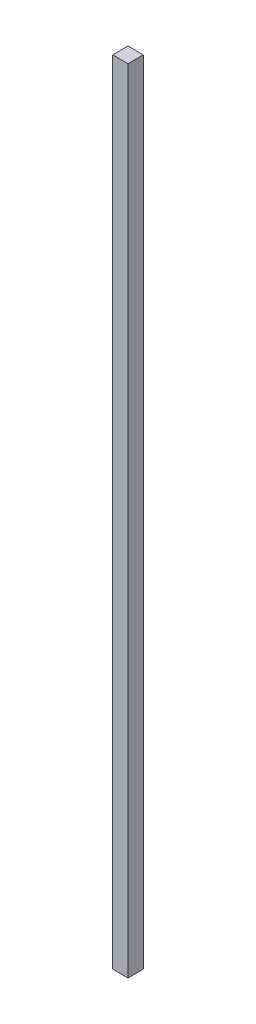
ISO-10303-21;
HEADER;
FILE_DESCRIPTION(('STEP AP214'),'2;1');
FILE_NAME('part.step','',(''),(''),'','','');
FILE_SCHEMA(('AUTOMOTIVE_DESIGN { 1 0 10303 214 1 1 1 1 }'));
ENDSEC;
DATA;
#1=APPLICATION_CONTEXT('core data for automotive mechanical design processes');
#2=APPLICATION_PROTOCOL_DEFINITION('international standard','automotive_design',2000,#1);
#3=PRODUCT_CONTEXT('',#1,'mechanical');
#4=PRODUCT('Part','Part','',(#3));
#5=PRODUCT_RELATED_PRODUCT_CATEGORY('part','',(#4));
#6=PRODUCT_DEFINITION_FORMATION('','',#4);
#7=PRODUCT_DEFINITION_CONTEXT('part definition',#1,'design');
#8=PRODUCT_DEFINITION('design','',#6,#7);
#9=PRODUCT_DEFINITION_SHAPE('','',#8);
#10=(LENGTH_UNIT() NAMED_UNIT(*) SI_UNIT(.MILLI.,.METRE.));
#11=(NAMED_UNIT(*) PLANE_ANGLE_UNIT() SI_UNIT($,.RADIAN.));
#12=(NAMED_UNIT(*) SI_UNIT($,.STERADIAN.) SOLID_ANGLE_UNIT());
#13=UNCERTAINTY_MEASURE_WITH_UNIT(LENGTH_MEASURE(1.E-05),#10,'distance_accuracy_value','');
#14=(GEOMETRIC_REPRESENTATION_CONTEXT(3) GLOBAL_UNCERTAINTY_ASSIGNED_CONTEXT((#13)) GLOBAL_UNIT_ASSIGNED_CONTEXT((#10,
#11,#12)) REPRESENTATION_CONTEXT('',''));
#15=CARTESIAN_POINT('',(0.,0.,0.));
#16=DIRECTION('',(0.,0.,1.));
#17=DIRECTION('',(1.,0.,0.));
#18=AXIS2_PLACEMENT_3D('',#15,#16,#17);
#19=CARTESIAN_POINT('',(-20.484022556391,21.218487394958,10.));
#20=DIRECTION('',(1.,0.,0.));
#21=DIRECTION('',(0.,1.,0.));
#22=AXIS2_PLACEMENT_3D('',#19,#20,#21);
#23=PLANE('',#22);
#24=DIRECTION('',(0.,-1.,0.));
#25=VECTOR('',#24,1.);
#26=CARTESIAN_POINT('',(-20.484022556391,21.218487394958,0.));
#27=LINE('',#26,#25);
#28=CARTESIAN_POINT('',(-20.484022556391,21.218487394958,0.));
#29=VERTEX_POINT('',#28);
#30=CARTESIAN_POINT('',(-20.4840225563909,-495.781512605042,0.));
#31=VERTEX_POINT('',#30);
#32=EDGE_CURVE('E96',#29,#31,#27,.T.);
#33=ORIENTED_EDGE('',*,*,#32,.T.);
#34=DIRECTION('',(0.,0.,-1.));
#35=VECTOR('',#34,1.);
#36=CARTESIAN_POINT('',(-20.4840225563909,-495.781512605042,10.));
#37=LINE('',#36,#35);
#38=CARTESIAN_POINT('',(-20.4840225563909,-495.781512605042,10.));
#39=VERTEX_POINT('',#38);
#40=EDGE_CURVE('E11',#39,#31,#37,.T.);
#41=ORIENTED_EDGE('',*,*,#40,.F.);
#42=DIRECTION('',(0.,-1.,0.));
#43=VECTOR('',#42,1.);
#44=CARTESIAN_POINT('',(-20.484022556391,21.218487394958,10.));
#45=LINE('',#44,#43);
#46=CARTESIAN_POINT('',(-20.484022556391,21.218487394958,10.));
#47=VERTEX_POINT('',#46);
#48=EDGE_CURVE('E84',#47,#39,#45,.T.);
#49=ORIENTED_EDGE('',*,*,#48,.F.);
#50=DIRECTION('',(0.,0.,-1.));
#51=VECTOR('',#50,1.);
#52=CARTESIAN_POINT('',(-20.484022556391,21.218487394958,10.));
#53=LINE('',#52,#51);
#54=EDGE_CURVE('E92',#47,#29,#53,.T.);
#55=ORIENTED_EDGE('',*,*,#54,.T.);
#56=EDGE_LOOP('',(#33,#41,#49,#55));
#57=FACE_BOUND('',#56,.T.);
#58=ADVANCED_FACE('F33',(#57),#23,.F.);
#59=CARTESIAN_POINT('',(-20.4840225563909,-495.781512605042,10.));
#60=DIRECTION('',(0.,1.,0.));
#61=DIRECTION('',(0.,0.,1.));
#62=AXIS2_PLACEMENT_3D('',#59,#60,#61);
#63=PLANE('',#62);
#64=DIRECTION('',(1.,0.,0.));
#65=VECTOR('',#64,1.);
#66=CARTESIAN_POINT('',(-20.4840225563909,-495.781512605042,0.));
#67=LINE('',#66,#65);
#68=CARTESIAN_POINT('',(-10.4840225563909,-495.781512605042,0.));
#69=VERTEX_POINT('',#68);
#70=EDGE_CURVE('E88',#31,#69,#67,.T.);
#71=ORIENTED_EDGE('',*,*,#70,.T.);
#72=DIRECTION('',(0.,0.,-1.));
#73=VECTOR('',#72,1.);
#74=CARTESIAN_POINT('',(-10.4840225563909,-495.781512605042,10.));
#75=LINE('',#74,#73);
#76=CARTESIAN_POINT('',(-10.4840225563909,-495.781512605042,10.));
#77=VERTEX_POINT('',#76);
#78=EDGE_CURVE('E41',#77,#69,#75,.T.);
#79=ORIENTED_EDGE('',*,*,#78,.F.);
#80=DIRECTION('',(1.,0.,0.));
#81=VECTOR('',#80,1.);
#82=CARTESIAN_POINT('',(-20.4840225563909,-495.781512605042,10.));
#83=LINE('',#82,#81);
#84=EDGE_CURVE('E79',#39,#77,#83,.T.);
#85=ORIENTED_EDGE('',*,*,#84,.F.);
#86=ORIENTED_EDGE('',*,*,#40,.T.);
#87=EDGE_LOOP('',(#71,#79,#85,#86));
#88=FACE_BOUND('',#87,.T.);
#89=ADVANCED_FACE('F87',(#88),#63,.F.);
#90=CARTESIAN_POINT('',(-10.484022556391,21.218487394958,10.));
#91=DIRECTION('',(-1.,0.,0.));
#92=DIRECTION('',(0.,-1.,0.));
#93=AXIS2_PLACEMENT_3D('',#90,#91,#92);
#94=PLANE('',#93);
#95=DIRECTION('',(0.,1.,0.));
#96=VECTOR('',#95,1.);
#97=CARTESIAN_POINT('',(-10.484022556391,21.218487394958,0.));
#98=LINE('',#97,#96);
#99=CARTESIAN_POINT('',(-10.484022556391,21.218487394958,0.));
#100=VERTEX_POINT('',#99);
#101=EDGE_CURVE('E66',#69,#100,#98,.T.);
#102=ORIENTED_EDGE('',*,*,#101,.T.);
#103=DIRECTION('',(0.,0.,-1.));
#104=VECTOR('',#103,1.);
#105=CARTESIAN_POINT('',(-10.484022556391,21.218487394958,10.));
#106=LINE('',#105,#104);
#107=CARTESIAN_POINT('',(-10.484022556391,21.218487394958,10.));
#108=VERTEX_POINT('',#107);
#109=EDGE_CURVE('E89',#108,#100,#106,.T.);
#110=ORIENTED_EDGE('',*,*,#109,.F.);
#111=DIRECTION('',(0.,1.,0.));
#112=VECTOR('',#111,1.);
#113=CARTESIAN_POINT('',(-10.484022556391,21.218487394958,10.));
#114=LINE('',#113,#112);
#115=EDGE_CURVE('E82',#77,#108,#114,.T.);
#116=ORIENTED_EDGE('',*,*,#115,.F.);
#117=ORIENTED_EDGE('',*,*,#78,.T.);
#118=EDGE_LOOP('',(#102,#110,#116,#117));
#119=FACE_BOUND('',#118,.T.);
#120=ADVANCED_FACE('F90',(#119),#94,.F.);
#121=CARTESIAN_POINT('',(-20.484022556391,21.218487394958,10.));
#122=DIRECTION('',(0.,-1.,0.));
#123=DIRECTION('',(0.,0.,-1.));
#124=AXIS2_PLACEMENT_3D('',#121,#122,#123);
#125=PLANE('',#124);
#126=DIRECTION('',(-1.,0.,0.));
#127=VECTOR('',#126,1.);
#128=CARTESIAN_POINT('',(-20.484022556391,21.218487394958,0.));
#129=LINE('',#128,#127);
#130=EDGE_CURVE('E72',#100,#29,#129,.T.);
#131=ORIENTED_EDGE('',*,*,#130,.T.);
#132=ORIENTED_EDGE('',*,*,#54,.F.);
#133=DIRECTION('',(-1.,0.,0.));
#134=VECTOR('',#133,1.);
#135=CARTESIAN_POINT('',(-20.484022556391,21.218487394958,10.));
#136=LINE('',#135,#134);
#137=EDGE_CURVE('E49',#108,#47,#136,.T.);
#138=ORIENTED_EDGE('',*,*,#137,.F.);
#139=ORIENTED_EDGE('',*,*,#109,.T.);
#140=EDGE_LOOP('',(#131,#132,#138,#139));
#141=FACE_BOUND('',#140,.T.);
#142=ADVANCED_FACE('F103',(#141),#125,.F.);
#143=CARTESIAN_POINT('',(0.,0.,10.));
#144=DIRECTION('',(0.,0.,1.));
#145=DIRECTION('',(1.,0.,0.));
#146=AXIS2_PLACEMENT_3D('',#143,#144,#145);
#147=PLANE('',#146);
#148=ORIENTED_EDGE('',*,*,#48,.T.);
#149=ORIENTED_EDGE('',*,*,#84,.T.);
#150=ORIENTED_EDGE('',*,*,#115,.T.);
#151=ORIENTED_EDGE('',*,*,#137,.T.);
#152=EDGE_LOOP('',(#148,#149,#150,#151));
#153=FACE_BOUND('',#152,.T.);
#154=ADVANCED_FACE('F80',(#153),#147,.T.);
#155=CARTESIAN_POINT('',(0.,0.,0.));
#156=DIRECTION('',(0.,0.,1.));
#157=DIRECTION('',(1.,0.,0.));
#158=AXIS2_PLACEMENT_3D('',#155,#156,#157);
#159=PLANE('',#158);
#160=ORIENTED_EDGE('',*,*,#32,.F.);
#161=ORIENTED_EDGE('',*,*,#130,.F.);
#162=ORIENTED_EDGE('',*,*,#101,.F.);
#163=ORIENTED_EDGE('',*,*,#70,.F.);
#164=EDGE_LOOP('',(#160,#161,#162,#163));
#165=FACE_BOUND('',#164,.T.);
#166=ADVANCED_FACE('F106',(#165),#159,.F.);
#167=CLOSED_SHELL('',(#58,#89,#120,#142,#154,#166));
#168=MANIFOLD_SOLID_BREP('B2',#167);
#169=ADVANCED_BREP_SHAPE_REPRESENTATION('',(#18,#168),#14);
#170=SHAPE_DEFINITION_REPRESENTATION(#9,#169);
ENDSEC;
END-ISO-10303-21;
